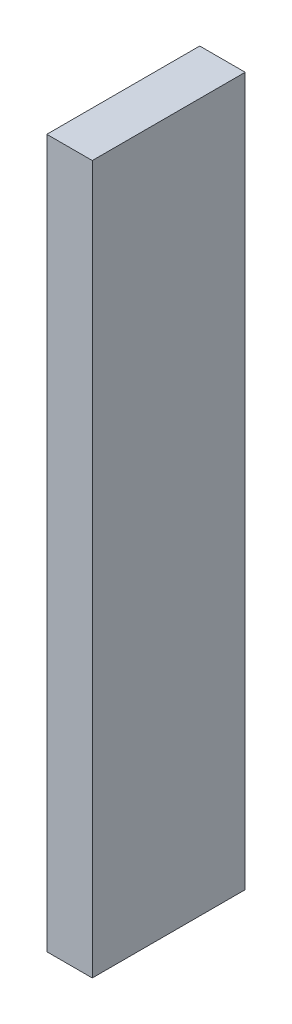
ISO-10303-21;
HEADER;
FILE_DESCRIPTION(('STEP AP214'),'2;1');
FILE_NAME('part.step','',(''),(''),'','','');
FILE_SCHEMA(('AUTOMOTIVE_DESIGN { 1 0 10303 214 1 1 1 1 }'));
ENDSEC;
DATA;
#1=APPLICATION_CONTEXT('core data for automotive mechanical design processes');
#2=APPLICATION_PROTOCOL_DEFINITION('international standard','automotive_design',2000,#1);
#3=PRODUCT_CONTEXT('',#1,'mechanical');
#4=PRODUCT('Part','Part','',(#3));
#5=PRODUCT_RELATED_PRODUCT_CATEGORY('part','',(#4));
#6=PRODUCT_DEFINITION_FORMATION('','',#4);
#7=PRODUCT_DEFINITION_CONTEXT('part definition',#1,'design');
#8=PRODUCT_DEFINITION('design','',#6,#7);
#9=PRODUCT_DEFINITION_SHAPE('','',#8);
#10=(LENGTH_UNIT() NAMED_UNIT(*) SI_UNIT(.MILLI.,.METRE.));
#11=(NAMED_UNIT(*) PLANE_ANGLE_UNIT() SI_UNIT($,.RADIAN.));
#12=(NAMED_UNIT(*) SI_UNIT($,.STERADIAN.) SOLID_ANGLE_UNIT());
#13=UNCERTAINTY_MEASURE_WITH_UNIT(LENGTH_MEASURE(1.E-05),#10,'distance_accuracy_value','');
#14=(GEOMETRIC_REPRESENTATION_CONTEXT(3) GLOBAL_UNCERTAINTY_ASSIGNED_CONTEXT((#13)) GLOBAL_UNIT_ASSIGNED_CONTEXT((#10,
#11,#12)) REPRESENTATION_CONTEXT('',''));
#15=CARTESIAN_POINT('',(0.,0.,0.));
#16=DIRECTION('',(0.,0.,1.));
#17=DIRECTION('',(1.,0.,0.));
#18=AXIS2_PLACEMENT_3D('',#15,#16,#17);
#19=CARTESIAN_POINT('',(130.275545263252,22.4180708263693,56.0720244776067));
#20=DIRECTION('',(-1.69244514382854E-09,0.,1.));
#21=DIRECTION('',(1.,0.,1.69244514382854E-09));
#22=AXIS2_PLACEMENT_3D('',#19,#20,#21);
#23=PLANE('',#22);
#24=DIRECTION('',(0.,-1.,0.));
#25=VECTOR('',#24,1.);
#26=CARTESIAN_POINT('',(131.258630360265,22.4180708263693,56.0720244792706));
#27=LINE('',#26,#25);
#28=CARTESIAN_POINT('',(131.258630360265,22.4180708263693,56.0720244792706));
#29=VERTEX_POINT('',#28);
#30=CARTESIAN_POINT('',(131.258630360265,7.11212965552236,56.0720244792705));
#31=VERTEX_POINT('',#30);
#32=EDGE_CURVE('E79',#29,#31,#27,.T.);
#33=ORIENTED_EDGE('',*,*,#32,.F.);
#34=DIRECTION('',(1.,0.,1.69244514382854E-09));
#35=VECTOR('',#34,1.);
#36=CARTESIAN_POINT('',(130.275545263252,22.4180708263693,56.0720244776067));
#37=LINE('',#36,#35);
#38=CARTESIAN_POINT('',(130.275545263252,22.4180708263693,56.0720244776067));
#39=VERTEX_POINT('',#38);
#40=EDGE_CURVE('E32',#39,#29,#37,.T.);
#41=ORIENTED_EDGE('',*,*,#40,.F.);
#42=DIRECTION('',(0.,-1.,0.));
#43=VECTOR('',#42,1.);
#44=CARTESIAN_POINT('',(130.275545263252,22.4180708263693,56.0720244776067));
#45=LINE('',#44,#43);
#46=CARTESIAN_POINT('',(130.275545263252,7.11212965552236,56.0720244776067));
#47=VERTEX_POINT('',#46);
#48=EDGE_CURVE('E71',#39,#47,#45,.T.);
#49=ORIENTED_EDGE('',*,*,#48,.T.);
#50=DIRECTION('',(1.,0.,1.69244514382854E-09));
#51=VECTOR('',#50,1.);
#52=CARTESIAN_POINT('',(130.275545263252,7.11212965552236,56.0720244776067));
#53=LINE('',#52,#51);
#54=EDGE_CURVE('E10',#47,#31,#53,.T.);
#55=ORIENTED_EDGE('',*,*,#54,.T.);
#56=EDGE_LOOP('',(#33,#41,#49,#55));
#57=FACE_BOUND('',#56,.T.);
#58=ADVANCED_FACE('F16',(#57),#23,.T.);
#59=CARTESIAN_POINT('',(130.275545263252,7.11212965552236,56.0720244776067));
#60=DIRECTION('',(0.,-1.,0.));
#61=DIRECTION('',(0.,0.,-1.));
#62=AXIS2_PLACEMENT_3D('',#59,#60,#61);
#63=PLANE('',#62);
#64=DIRECTION('',(1.69244514382854E-09,0.,-1.));
#65=VECTOR('',#64,1.);
#66=CARTESIAN_POINT('',(131.258630360265,7.11212965552236,56.0720244792705));
#67=LINE('',#66,#65);
#68=CARTESIAN_POINT('',(131.25863036586,7.11212965552235,52.7660833084218));
#69=VERTEX_POINT('',#68);
#70=EDGE_CURVE('E82',#31,#69,#67,.T.);
#71=ORIENTED_EDGE('',*,*,#70,.F.);
#72=ORIENTED_EDGE('',*,*,#54,.F.);
#73=DIRECTION('',(1.69244514382854E-09,0.,-1.));
#74=VECTOR('',#73,1.);
#75=CARTESIAN_POINT('',(130.275545263252,7.11212965552236,56.0720244776067));
#76=LINE('',#75,#74);
#77=CARTESIAN_POINT('',(130.275545268847,7.11212965552235,52.766083306758));
#78=VERTEX_POINT('',#77);
#79=EDGE_CURVE('E67',#47,#78,#76,.T.);
#80=ORIENTED_EDGE('',*,*,#79,.T.);
#81=DIRECTION('',(1.,0.,1.69244514382854E-09));
#82=VECTOR('',#81,1.);
#83=CARTESIAN_POINT('',(130.275545268847,7.11212965552235,52.766083306758));
#84=LINE('',#83,#82);
#85=EDGE_CURVE('E24',#78,#69,#84,.T.);
#86=ORIENTED_EDGE('',*,*,#85,.T.);
#87=EDGE_LOOP('',(#71,#72,#80,#86));
#88=FACE_BOUND('',#87,.T.);
#89=ADVANCED_FACE('F68',(#88),#63,.T.);
#90=CARTESIAN_POINT('',(130.275545268847,7.11212965552235,52.766083306758));
#91=DIRECTION('',(1.69244514382854E-09,0.,-1.));
#92=DIRECTION('',(-1.,0.,-1.69244514382854E-09));
#93=AXIS2_PLACEMENT_3D('',#90,#91,#92);
#94=PLANE('',#93);
#95=DIRECTION('',(0.,1.,0.));
#96=VECTOR('',#95,1.);
#97=CARTESIAN_POINT('',(131.25863036586,7.11212965552235,52.7660833084218));
#98=LINE('',#97,#96);
#99=CARTESIAN_POINT('',(131.25863036586,22.418070826371,52.7660832999613));
#100=VERTEX_POINT('',#99);
#101=EDGE_CURVE('E65',#69,#100,#98,.T.);
#102=ORIENTED_EDGE('',*,*,#101,.F.);
#103=ORIENTED_EDGE('',*,*,#85,.F.);
#104=DIRECTION('',(0.,1.,0.));
#105=VECTOR('',#104,1.);
#106=CARTESIAN_POINT('',(130.275545268847,7.11212965552235,52.766083306758));
#107=LINE('',#106,#105);
#108=CARTESIAN_POINT('',(130.275545268847,22.418070826371,52.7660832982974));
#109=VERTEX_POINT('',#108);
#110=EDGE_CURVE('E62',#78,#109,#107,.T.);
#111=ORIENTED_EDGE('',*,*,#110,.T.);
#112=DIRECTION('',(1.,0.,1.69244514382854E-09));
#113=VECTOR('',#112,1.);
#114=CARTESIAN_POINT('',(130.275545268847,22.418070826371,52.7660832982974));
#115=LINE('',#114,#113);
#116=EDGE_CURVE('E48',#109,#100,#115,.T.);
#117=ORIENTED_EDGE('',*,*,#116,.T.);
#118=EDGE_LOOP('',(#102,#103,#111,#117));
#119=FACE_BOUND('',#118,.T.);
#120=ADVANCED_FACE('F60',(#119),#94,.T.);
#121=CARTESIAN_POINT('',(130.275545268847,22.418070826371,52.7660832982974));
#122=DIRECTION('',(0.,1.,0.));
#123=DIRECTION('',(-1.,0.,0.));
#124=AXIS2_PLACEMENT_3D('',#121,#122,#123);
#125=PLANE('',#124);
#126=DIRECTION('',(-1.69244514382854E-09,0.,1.));
#127=VECTOR('',#126,1.);
#128=CARTESIAN_POINT('',(131.25863036586,22.418070826371,52.7660832999613));
#129=LINE('',#128,#127);
#130=EDGE_CURVE('E85',#100,#29,#129,.T.);
#131=ORIENTED_EDGE('',*,*,#130,.F.);
#132=ORIENTED_EDGE('',*,*,#116,.F.);
#133=DIRECTION('',(-1.69244514382854E-09,0.,1.));
#134=VECTOR('',#133,1.);
#135=CARTESIAN_POINT('',(130.275545268847,22.418070826371,52.7660832982974));
#136=LINE('',#135,#134);
#137=EDGE_CURVE('E74',#109,#39,#136,.T.);
#138=ORIENTED_EDGE('',*,*,#137,.T.);
#139=ORIENTED_EDGE('',*,*,#40,.T.);
#140=EDGE_LOOP('',(#131,#132,#138,#139));
#141=FACE_BOUND('',#140,.T.);
#142=ADVANCED_FACE('F96',(#141),#125,.T.);
#143=CARTESIAN_POINT('',(130.275545201028,17.2651002409467,92.8378607087388));
#144=DIRECTION('',(1.,0.,1.69244514382854E-09));
#145=DIRECTION('',(0.,1.,0.));
#146=AXIS2_PLACEMENT_3D('',#143,#144,#145);
#147=PLANE('',#146);
#148=ORIENTED_EDGE('',*,*,#48,.F.);
#149=ORIENTED_EDGE('',*,*,#137,.F.);
#150=ORIENTED_EDGE('',*,*,#110,.F.);
#151=ORIENTED_EDGE('',*,*,#79,.F.);
#152=EDGE_LOOP('',(#148,#149,#150,#151));
#153=FACE_BOUND('',#152,.T.);
#154=ADVANCED_FACE('F73',(#153),#147,.F.);
#155=CARTESIAN_POINT('',(131.258630298041,17.2651002409467,92.8378607104026));
#156=DIRECTION('',(1.,0.,1.69244514382854E-09));
#157=DIRECTION('',(0.,1.,0.));
#158=AXIS2_PLACEMENT_3D('',#155,#156,#157);
#159=PLANE('',#158);
#160=ORIENTED_EDGE('',*,*,#32,.T.);
#161=ORIENTED_EDGE('',*,*,#70,.T.);
#162=ORIENTED_EDGE('',*,*,#101,.T.);
#163=ORIENTED_EDGE('',*,*,#130,.T.);
#164=EDGE_LOOP('',(#160,#161,#162,#163));
#165=FACE_BOUND('',#164,.T.);
#166=ADVANCED_FACE('F89',(#165),#159,.T.);
#167=CLOSED_SHELL('',(#58,#89,#120,#142,#154,#166));
#168=MANIFOLD_SOLID_BREP('B1',#167);
#169=ADVANCED_BREP_SHAPE_REPRESENTATION('',(#18,#168),#14);
#170=SHAPE_DEFINITION_REPRESENTATION(#9,#169);
ENDSEC;
END-ISO-10303-21;
